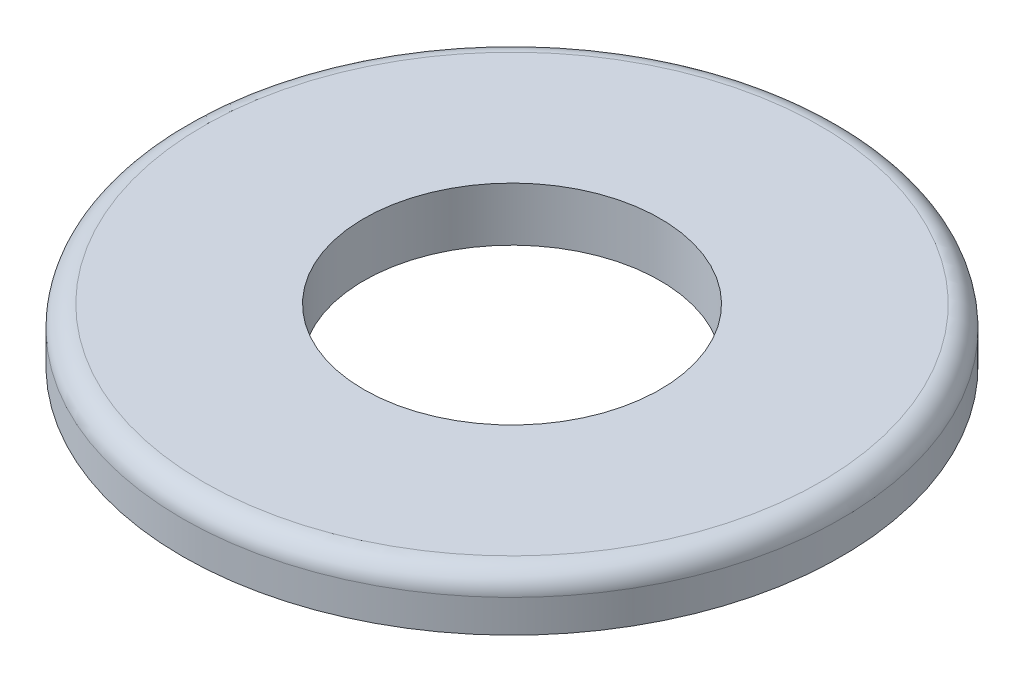
ISO-10303-21;
HEADER;
FILE_DESCRIPTION(('STEP AP214'),'2;1');
FILE_NAME('part.step','',(''),(''),'','','');
FILE_SCHEMA(('AUTOMOTIVE_DESIGN { 1 0 10303 214 1 1 1 1 }'));
ENDSEC;
DATA;
#1=APPLICATION_CONTEXT('core data for automotive mechanical design processes');
#2=APPLICATION_PROTOCOL_DEFINITION('international standard','automotive_design',2000,#1);
#3=PRODUCT_CONTEXT('',#1,'mechanical');
#4=PRODUCT('Part','Part','',(#3));
#5=PRODUCT_RELATED_PRODUCT_CATEGORY('part','',(#4));
#6=PRODUCT_DEFINITION_FORMATION('','',#4);
#7=PRODUCT_DEFINITION_CONTEXT('part definition',#1,'design');
#8=PRODUCT_DEFINITION('design','',#6,#7);
#9=PRODUCT_DEFINITION_SHAPE('','',#8);
#10=(LENGTH_UNIT() NAMED_UNIT(*) SI_UNIT(.MILLI.,.METRE.));
#11=(NAMED_UNIT(*) PLANE_ANGLE_UNIT() SI_UNIT($,.RADIAN.));
#12=(NAMED_UNIT(*) SI_UNIT($,.STERADIAN.) SOLID_ANGLE_UNIT());
#13=UNCERTAINTY_MEASURE_WITH_UNIT(LENGTH_MEASURE(1.E-05),#10,'distance_accuracy_value','');
#14=(GEOMETRIC_REPRESENTATION_CONTEXT(3) GLOBAL_UNCERTAINTY_ASSIGNED_CONTEXT((#13)) GLOBAL_UNIT_ASSIGNED_CONTEXT((#10,
#11,#12)) REPRESENTATION_CONTEXT('',''));
#15=CARTESIAN_POINT('',(0.,0.,0.));
#16=DIRECTION('',(0.,0.,1.));
#17=DIRECTION('',(1.,0.,0.));
#18=AXIS2_PLACEMENT_3D('',#15,#16,#17);
#19=CARTESIAN_POINT('',(0.,0.647699999999996,0.));
#20=DIRECTION('',(0.,1.,0.));
#21=DIRECTION('',(0.,0.,1.));
#22=AXIS2_PLACEMENT_3D('',#19,#20,#21);
#23=PLANE('',#22);
#24=CARTESIAN_POINT('',(0.,0.647699999999996,0.));
#25=DIRECTION('',(0.,1.,0.));
#26=DIRECTION('',(0.,0.,1.));
#27=AXIS2_PLACEMENT_3D('',#24,#25,#26);
#28=CIRCLE('',#27,7.4295);
#29=CARTESIAN_POINT('',(0.,0.647699999999996,7.4295));
#30=VERTEX_POINT('',#29);
#31=EDGE_CURVE('E46',#30,#30,#28,.T.);
#32=ORIENTED_EDGE('',*,*,#31,.T.);
#33=EDGE_LOOP('',(#32));
#34=FACE_BOUND('',#33,.T.);
#35=CARTESIAN_POINT('',(0.,0.647699999999996,0.));
#36=DIRECTION('',(0.,1.,0.));
#37=DIRECTION('',(0.,0.,1.));
#38=AXIS2_PLACEMENT_3D('',#35,#36,#37);
#39=CIRCLE('',#38,3.5687);
#40=CARTESIAN_POINT('',(0.,0.647699999999996,3.5687));
#41=VERTEX_POINT('',#40);
#42=EDGE_CURVE('E50',#41,#41,#39,.T.);
#43=ORIENTED_EDGE('',*,*,#42,.F.);
#44=EDGE_LOOP('',(#43));
#45=FACE_BOUND('',#44,.T.);
#46=ADVANCED_FACE('F39',(#34,#45),#23,.T.);
#47=CARTESIAN_POINT('',(0.,0.647699999999996,0.));
#48=DIRECTION('',(0.,-1.,0.));
#49=DIRECTION('',(0.,0.,-1.));
#50=AXIS2_PLACEMENT_3D('',#47,#48,#49);
#51=CYLINDRICAL_SURFACE('',#50,7.9375);
#52=CARTESIAN_POINT('',(0.,0.139699999999996,0.));
#53=DIRECTION('',(0.,1.,0.));
#54=DIRECTION('',(0.,0.,1.));
#55=AXIS2_PLACEMENT_3D('',#52,#53,#54);
#56=CIRCLE('',#55,7.9375);
#57=CARTESIAN_POINT('',(0.,0.139699999999996,7.9375));
#58=VERTEX_POINT('',#57);
#59=EDGE_CURVE('E10',#58,#58,#56,.F.);
#60=ORIENTED_EDGE('',*,*,#59,.T.);
#61=EDGE_LOOP('',(#60));
#62=FACE_BOUND('',#61,.T.);
#63=CARTESIAN_POINT('',(0.,-0.647700000000004,0.));
#64=DIRECTION('',(0.,1.,0.));
#65=DIRECTION('',(0.,0.,1.));
#66=AXIS2_PLACEMENT_3D('',#63,#64,#65);
#67=CIRCLE('',#66,7.9375);
#68=CARTESIAN_POINT('',(0.,-0.647700000000004,7.9375));
#69=VERTEX_POINT('',#68);
#70=EDGE_CURVE('E54',#69,#69,#67,.T.);
#71=ORIENTED_EDGE('',*,*,#70,.T.);
#72=EDGE_LOOP('',(#71));
#73=FACE_BOUND('',#72,.T.);
#74=ADVANCED_FACE('F68',(#62,#73),#51,.T.);
#75=CARTESIAN_POINT('',(0.,0.647699999999996,0.));
#76=DIRECTION('',(0.,-1.,0.));
#77=DIRECTION('',(0.,0.,-1.));
#78=AXIS2_PLACEMENT_3D('',#75,#76,#77);
#79=CYLINDRICAL_SURFACE('',#78,3.5687);
#80=ORIENTED_EDGE('',*,*,#42,.T.);
#81=EDGE_LOOP('',(#80));
#82=FACE_BOUND('',#81,.T.);
#83=CARTESIAN_POINT('',(0.,-0.647700000000004,0.));
#84=DIRECTION('',(0.,1.,0.));
#85=DIRECTION('',(0.,0.,1.));
#86=AXIS2_PLACEMENT_3D('',#83,#84,#85);
#87=CIRCLE('',#86,3.5687);
#88=CARTESIAN_POINT('',(0.,-0.647700000000004,3.5687));
#89=VERTEX_POINT('',#88);
#90=EDGE_CURVE('E59',#89,#89,#87,.T.);
#91=ORIENTED_EDGE('',*,*,#90,.F.);
#92=EDGE_LOOP('',(#91));
#93=FACE_BOUND('',#92,.T.);
#94=ADVANCED_FACE('F66',(#82,#93),#79,.F.);
#95=CARTESIAN_POINT('',(0.,-0.647700000000004,0.));
#96=DIRECTION('',(0.,1.,0.));
#97=DIRECTION('',(0.,0.,1.));
#98=AXIS2_PLACEMENT_3D('',#95,#96,#97);
#99=PLANE('',#98);
#100=ORIENTED_EDGE('',*,*,#90,.T.);
#101=EDGE_LOOP('',(#100));
#102=FACE_BOUND('',#101,.T.);
#103=ORIENTED_EDGE('',*,*,#70,.F.);
#104=EDGE_LOOP('',(#103));
#105=FACE_BOUND('',#104,.T.);
#106=ADVANCED_FACE('F63',(#102,#105),#99,.F.);
#107=CARTESIAN_POINT('',(0.,0.139699999999996,0.));
#108=DIRECTION('',(0.,1.,0.));
#109=DIRECTION('',(0.,0.,1.));
#110=AXIS2_PLACEMENT_3D('',#107,#108,#109);
#111=TOROIDAL_SURFACE('',#110,7.4295,0.508);
#112=ORIENTED_EDGE('',*,*,#59,.F.);
#113=EDGE_LOOP('',(#112));
#114=FACE_BOUND('',#113,.T.);
#115=ORIENTED_EDGE('',*,*,#31,.F.);
#116=EDGE_LOOP('',(#115));
#117=FACE_BOUND('',#116,.T.);
#118=ADVANCED_FACE('F41',(#114,#117),#111,.T.);
#119=CLOSED_SHELL('',(#46,#74,#94,#106,#118));
#120=MANIFOLD_SOLID_BREP('B2',#119);
#121=ADVANCED_BREP_SHAPE_REPRESENTATION('',(#18,#120),#14);
#122=SHAPE_DEFINITION_REPRESENTATION(#9,#121);
ENDSEC;
END-ISO-10303-21;
